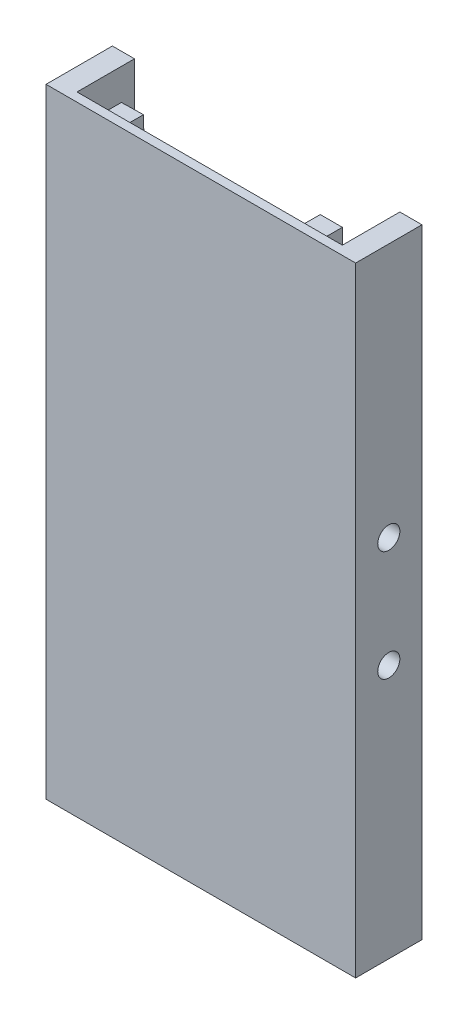
ISO-10303-21;
HEADER;
FILE_DESCRIPTION(('STEP AP214'),'2;1');
FILE_NAME('part.step','',(''),(''),'','','');
FILE_SCHEMA(('AUTOMOTIVE_DESIGN { 1 0 10303 214 1 1 1 1 }'));
ENDSEC;
DATA;
#1=APPLICATION_CONTEXT('core data for automotive mechanical design processes');
#2=APPLICATION_PROTOCOL_DEFINITION('international standard','automotive_design',2000,#1);
#3=PRODUCT_CONTEXT('',#1,'mechanical');
#4=PRODUCT('Part','Part','',(#3));
#5=PRODUCT_RELATED_PRODUCT_CATEGORY('part','',(#4));
#6=PRODUCT_DEFINITION_FORMATION('','',#4);
#7=PRODUCT_DEFINITION_CONTEXT('part definition',#1,'design');
#8=PRODUCT_DEFINITION('design','',#6,#7);
#9=PRODUCT_DEFINITION_SHAPE('','',#8);
#10=(LENGTH_UNIT() NAMED_UNIT(*) SI_UNIT(.MILLI.,.METRE.));
#11=(NAMED_UNIT(*) PLANE_ANGLE_UNIT() SI_UNIT($,.RADIAN.));
#12=(NAMED_UNIT(*) SI_UNIT($,.STERADIAN.) SOLID_ANGLE_UNIT());
#13=UNCERTAINTY_MEASURE_WITH_UNIT(LENGTH_MEASURE(1.E-05),#10,'distance_accuracy_value','');
#14=(GEOMETRIC_REPRESENTATION_CONTEXT(3) GLOBAL_UNCERTAINTY_ASSIGNED_CONTEXT((#13)) GLOBAL_UNIT_ASSIGNED_CONTEXT((#10,
#11,#12)) REPRESENTATION_CONTEXT('',''));
#15=CARTESIAN_POINT('',(0.,0.,0.));
#16=DIRECTION('',(0.,0.,1.));
#17=DIRECTION('',(1.,0.,0.));
#18=AXIS2_PLACEMENT_3D('',#15,#16,#17);
#19=CARTESIAN_POINT('',(65.,298.888888888889,-2.));
#20=DIRECTION('',(0.,0.,1.));
#21=DIRECTION('',(1.,0.,0.));
#22=AXIS2_PLACEMENT_3D('',#19,#20,#21);
#23=PLANE('',#22);
#24=DIRECTION('',(0.0214261117983908,0.999770434516446,0.));
#25=VECTOR('',#24,1.);
#26=CARTESIAN_POINT('',(10.0378783047865,300.924197335623,-1.99999999999999));
#27=LINE('',#26,#25);
#28=CARTESIAN_POINT('',(10.0378783047865,300.924197335623,-1.99999999999999));
#29=VERTEX_POINT('',#28);
#30=CARTESIAN_POINT('',(10.1450088637784,305.923049508205,-1.99999999999999));
#31=VERTEX_POINT('',#30);
#32=EDGE_CURVE('E224',#29,#31,#27,.T.);
#33=ORIENTED_EDGE('',*,*,#32,.F.);
#34=DIRECTION('',(-0.999770434516446,0.0214261117983949,0.));
#35=VECTOR('',#34,1.);
#36=CARTESIAN_POINT('',(10.0378783047865,300.924197335623,-1.99999999999999));
#37=LINE('',#36,#35);
#38=CARTESIAN_POINT('',(15.0367304773687,300.817066776631,-1.99999999999999));
#39=VERTEX_POINT('',#38);
#40=EDGE_CURVE('E237',#39,#29,#37,.T.);
#41=ORIENTED_EDGE('',*,*,#40,.F.);
#42=DIRECTION('',(-0.0214261117983908,-0.999770434516446,0.));
#43=VECTOR('',#42,1.);
#44=CARTESIAN_POINT('',(15.0367304773687,300.817066776631,-1.99999999999999));
#45=LINE('',#44,#43);
#46=CARTESIAN_POINT('',(15.1438610363607,305.815918949213,-1.99999999999999));
#47=VERTEX_POINT('',#46);
#48=EDGE_CURVE('E246',#47,#39,#45,.T.);
#49=ORIENTED_EDGE('',*,*,#48,.F.);
#50=DIRECTION('',(0.999770434516446,-0.0214261117983949,0.));
#51=VECTOR('',#50,1.);
#52=CARTESIAN_POINT('',(10.1450088637784,305.923049508205,-1.99999999999999));
#53=LINE('',#52,#51);
#54=EDGE_CURVE('E227',#31,#47,#53,.T.);
#55=ORIENTED_EDGE('',*,*,#54,.F.);
#56=EDGE_LOOP('',(#33,#41,#49,#55));
#57=FACE_BOUND('',#56,.T.);
#58=DIRECTION('',(0.,-1.,0.));
#59=VECTOR('',#58,1.);
#60=CARTESIAN_POINT('',(60.,437.388888888889,-2.));
#61=LINE('',#60,#59);
#62=CARTESIAN_POINT('',(60.,437.388888888889,-2.));
#63=VERTEX_POINT('',#62);
#64=CARTESIAN_POINT('',(60.,432.388888888889,-2.));
#65=VERTEX_POINT('',#64);
#66=EDGE_CURVE('E295',#63,#65,#61,.T.);
#67=ORIENTED_EDGE('',*,*,#66,.F.);
#68=DIRECTION('',(1.,0.,0.));
#69=VECTOR('',#68,1.);
#70=CARTESIAN_POINT('',(60.,437.388888888889,-2.));
#71=LINE('',#70,#69);
#72=CARTESIAN_POINT('',(55.,437.388888888889,-2.));
#73=VERTEX_POINT('',#72);
#74=EDGE_CURVE('E300',#73,#63,#71,.T.);
#75=ORIENTED_EDGE('',*,*,#74,.F.);
#76=DIRECTION('',(0.,1.,0.));
#77=VECTOR('',#76,1.);
#78=CARTESIAN_POINT('',(55.,437.388888888889,-2.));
#79=LINE('',#78,#77);
#80=CARTESIAN_POINT('',(55.,432.388888888889,-2.));
#81=VERTEX_POINT('',#80);
#82=EDGE_CURVE('E312',#81,#73,#79,.T.);
#83=ORIENTED_EDGE('',*,*,#82,.F.);
#84=DIRECTION('',(-1.,0.,0.));
#85=VECTOR('',#84,1.);
#86=CARTESIAN_POINT('',(60.,432.388888888889,-2.));
#87=LINE('',#86,#85);
#88=EDGE_CURVE('E309',#65,#81,#87,.T.);
#89=ORIENTED_EDGE('',*,*,#88,.F.);
#90=EDGE_LOOP('',(#67,#75,#83,#89));
#91=FACE_BOUND('',#90,.T.);
#92=DIRECTION('',(1.,0.,0.));
#93=VECTOR('',#92,1.);
#94=CARTESIAN_POINT('',(65.,438.888888888889,-2.));
#95=LINE('',#94,#93);
#96=CARTESIAN_POINT('',(5.,438.888888888889,-1.99999999999999));
#97=VERTEX_POINT('',#96);
#98=CARTESIAN_POINT('',(65.,438.888888888889,-2.));
#99=VERTEX_POINT('',#98);
#100=EDGE_CURVE('E369',#97,#99,#95,.T.);
#101=ORIENTED_EDGE('',*,*,#100,.T.);
#102=DIRECTION('',(0.,1.,0.));
#103=VECTOR('',#102,1.);
#104=CARTESIAN_POINT('',(65.,298.888888888889,-2.));
#105=LINE('',#104,#103);
#106=CARTESIAN_POINT('',(65.,298.888888888889,-2.));
#107=VERTEX_POINT('',#106);
#108=EDGE_CURVE('E374',#107,#99,#105,.T.);
#109=ORIENTED_EDGE('',*,*,#108,.F.);
#110=DIRECTION('',(1.,0.,0.));
#111=VECTOR('',#110,1.);
#112=CARTESIAN_POINT('',(65.,298.888888888889,-2.));
#113=LINE('',#112,#111);
#114=CARTESIAN_POINT('',(36.5,298.888888888889,-1.99999999999997));
#115=VERTEX_POINT('',#114);
#116=EDGE_CURVE('E358',#115,#107,#113,.T.);
#117=ORIENTED_EDGE('',*,*,#116,.F.);
#118=DIRECTION('',(1.,0.,0.));
#119=VECTOR('',#118,1.);
#120=CARTESIAN_POINT('',(33.5,298.888888888889,-1.99999999999997));
#121=LINE('',#120,#119);
#122=CARTESIAN_POINT('',(33.5,298.888888888889,-2.));
#123=VERTEX_POINT('',#122);
#124=EDGE_CURVE('E333',#123,#115,#121,.T.);
#125=ORIENTED_EDGE('',*,*,#124,.F.);
#126=CARTESIAN_POINT('',(5.,298.888888888889,-1.99999999999999));
#127=VERTEX_POINT('',#126);
#128=EDGE_CURVE('E360',#127,#123,#113,.T.);
#129=ORIENTED_EDGE('',*,*,#128,.F.);
#130=DIRECTION('',(0.,1.,0.));
#131=VECTOR('',#130,1.);
#132=CARTESIAN_POINT('',(5.,298.888888888889,-1.99999999999999));
#133=LINE('',#132,#131);
#134=EDGE_CURVE('E366',#127,#97,#133,.T.);
#135=ORIENTED_EDGE('',*,*,#134,.T.);
#136=EDGE_LOOP('',(#101,#109,#117,#125,#129,#135));
#137=FACE_BOUND('',#136,.T.);
#138=DIRECTION('',(-0.0214261117983908,0.999770434516446,0.));
#139=VECTOR('',#138,1.);
#140=CARTESIAN_POINT('',(10.0378783047865,436.853580442154,-1.99999999999999));
#141=LINE('',#140,#139);
#142=CARTESIAN_POINT('',(10.1450088637784,431.854728269572,-1.99999999999999));
#143=VERTEX_POINT('',#142);
#144=CARTESIAN_POINT('',(10.0378783047864,436.853580442154,-1.99999999999999));
#145=VERTEX_POINT('',#144);
#146=EDGE_CURVE('E262',#143,#145,#141,.T.);
#147=ORIENTED_EDGE('',*,*,#146,.F.);
#148=DIRECTION('',(-0.999770434516446,-0.0214261117983949,0.));
#149=VECTOR('',#148,1.);
#150=CARTESIAN_POINT('',(10.1450088637784,431.854728269572,-1.99999999999999));
#151=LINE('',#150,#149);
#152=CARTESIAN_POINT('',(15.1438610363606,431.961858828564,-1.99999999999999));
#153=VERTEX_POINT('',#152);
#154=EDGE_CURVE('E267',#153,#143,#151,.T.);
#155=ORIENTED_EDGE('',*,*,#154,.F.);
#156=DIRECTION('',(0.0214261117983908,-0.999770434516446,0.));
#157=VECTOR('',#156,1.);
#158=CARTESIAN_POINT('',(15.0367304773687,436.960711001146,-1.99999999999999));
#159=LINE('',#158,#157);
#160=CARTESIAN_POINT('',(15.0367304773687,436.960711001146,-1.99999999999999));
#161=VERTEX_POINT('',#160);
#162=EDGE_CURVE('E279',#161,#153,#159,.T.);
#163=ORIENTED_EDGE('',*,*,#162,.F.);
#164=DIRECTION('',(0.999770434516446,0.0214261117983949,0.));
#165=VECTOR('',#164,1.);
#166=CARTESIAN_POINT('',(10.0378783047865,436.853580442154,-1.99999999999999));
#167=LINE('',#166,#165);
#168=EDGE_CURVE('E276',#145,#161,#167,.T.);
#169=ORIENTED_EDGE('',*,*,#168,.F.);
#170=EDGE_LOOP('',(#147,#155,#163,#169));
#171=FACE_BOUND('',#170,.T.);
#172=DIRECTION('',(0.,-1.,0.));
#173=VECTOR('',#172,1.);
#174=CARTESIAN_POINT('',(60.,300.388888888889,-2.));
#175=LINE('',#174,#173);
#176=CARTESIAN_POINT('',(60.,305.388888888889,-2.));
#177=VERTEX_POINT('',#176);
#178=CARTESIAN_POINT('',(60.,300.388888888889,-2.));
#179=VERTEX_POINT('',#178);
#180=EDGE_CURVE('E223',#177,#179,#175,.T.);
#181=ORIENTED_EDGE('',*,*,#180,.F.);
#182=DIRECTION('',(1.,0.,0.));
#183=VECTOR('',#182,1.);
#184=CARTESIAN_POINT('',(60.,305.388888888889,-2.));
#185=LINE('',#184,#183);
#186=CARTESIAN_POINT('',(55.,305.388888888889,-2.));
#187=VERTEX_POINT('',#186);
#188=EDGE_CURVE('E220',#187,#177,#185,.T.);
#189=ORIENTED_EDGE('',*,*,#188,.F.);
#190=DIRECTION('',(0.,1.,0.));
#191=VECTOR('',#190,1.);
#192=CARTESIAN_POINT('',(55.,300.388888888889,-2.));
#193=LINE('',#192,#191);
#194=CARTESIAN_POINT('',(55.,300.388888888889,-2.));
#195=VERTEX_POINT('',#194);
#196=EDGE_CURVE('E57',#195,#187,#193,.T.);
#197=ORIENTED_EDGE('',*,*,#196,.F.);
#198=DIRECTION('',(-1.,0.,0.));
#199=VECTOR('',#198,1.);
#200=CARTESIAN_POINT('',(60.,300.388888888889,-2.));
#201=LINE('',#200,#199);
#202=EDGE_CURVE('E52',#179,#195,#201,.T.);
#203=ORIENTED_EDGE('',*,*,#202,.F.);
#204=EDGE_LOOP('',(#181,#189,#197,#203));
#205=FACE_BOUND('',#204,.T.);
#206=ADVANCED_FACE('F35',(#57,#91,#137,#171,#205),#23,.F.);
#207=CARTESIAN_POINT('',(0.,0.,-15.));
#208=DIRECTION('',(0.,0.,1.));
#209=DIRECTION('',(1.,0.,0.));
#210=AXIS2_PLACEMENT_3D('',#207,#208,#209);
#211=PLANE('',#210);
#212=DIRECTION('',(1.,0.,0.));
#213=VECTOR('',#212,1.);
#214=CARTESIAN_POINT('',(0.,298.888888888889,-15.));
#215=LINE('',#214,#213);
#216=CARTESIAN_POINT('',(65.,298.888888888889,-15.));
#217=VERTEX_POINT('',#216);
#218=CARTESIAN_POINT('',(70.,298.888888888889,-15.));
#219=VERTEX_POINT('',#218);
#220=EDGE_CURVE('E386',#217,#219,#215,.T.);
#221=ORIENTED_EDGE('',*,*,#220,.F.);
#222=DIRECTION('',(0.,-1.,0.));
#223=VECTOR('',#222,1.);
#224=CARTESIAN_POINT('',(65.,433.888888888889,-15.));
#225=LINE('',#224,#223);
#226=CARTESIAN_POINT('',(65.,438.888888888889,-15.));
#227=VERTEX_POINT('',#226);
#228=EDGE_CURVE('E376',#227,#217,#225,.T.);
#229=ORIENTED_EDGE('',*,*,#228,.F.);
#230=DIRECTION('',(-1.,0.,0.));
#231=VECTOR('',#230,1.);
#232=CARTESIAN_POINT('',(0.,438.888888888889,-15.));
#233=LINE('',#232,#231);
#234=CARTESIAN_POINT('',(70.,438.888888888889,-15.));
#235=VERTEX_POINT('',#234);
#236=EDGE_CURVE('E390',#235,#227,#233,.T.);
#237=ORIENTED_EDGE('',*,*,#236,.F.);
#238=DIRECTION('',(0.,1.,0.));
#239=VECTOR('',#238,1.);
#240=CARTESIAN_POINT('',(70.,298.888888888889,-15.));
#241=LINE('',#240,#239);
#242=EDGE_CURVE('E385',#219,#235,#241,.T.);
#243=ORIENTED_EDGE('',*,*,#242,.F.);
#244=EDGE_LOOP('',(#221,#229,#237,#243));
#245=FACE_BOUND('',#244,.T.);
#246=ADVANCED_FACE('F438',(#245),#211,.F.);
#247=CARTESIAN_POINT('',(0.,298.888888888889,-15.));
#248=DIRECTION('',(0.,-1.,0.));
#249=DIRECTION('',(0.,0.,-1.));
#250=AXIS2_PLACEMENT_3D('',#247,#248,#249);
#251=PLANE('',#250);
#252=CARTESIAN_POINT('',(35.,298.888888888889,-1.99999999999999));
#253=DIRECTION('',(0.,-1.,0.));
#254=DIRECTION('',(0.,0.,1.));
#255=AXIS2_PLACEMENT_3D('',#252,#253,#254);
#256=CIRCLE('',#255,1.5);
#257=EDGE_CURVE('E328',#115,#123,#256,.T.);
#258=ORIENTED_EDGE('',*,*,#257,.F.);
#259=ORIENTED_EDGE('',*,*,#116,.T.);
#260=DIRECTION('',(0.,0.,-1.));
#261=VECTOR('',#260,1.);
#262=CARTESIAN_POINT('',(65.,298.888888888889,-15.));
#263=LINE('',#262,#261);
#264=EDGE_CURVE('E363',#107,#217,#263,.T.);
#265=ORIENTED_EDGE('',*,*,#264,.T.);
#266=ORIENTED_EDGE('',*,*,#220,.T.);
#267=DIRECTION('',(0.,0.,1.));
#268=VECTOR('',#267,1.);
#269=CARTESIAN_POINT('',(70.,298.888888888889,-15.));
#270=LINE('',#269,#268);
#271=CARTESIAN_POINT('',(70.,298.888888888889,0.));
#272=VERTEX_POINT('',#271);
#273=EDGE_CURVE('E396',#219,#272,#270,.T.);
#274=ORIENTED_EDGE('',*,*,#273,.T.);
#275=DIRECTION('',(1.,0.,0.));
#276=VECTOR('',#275,1.);
#277=CARTESIAN_POINT('',(0.,298.888888888889,0.));
#278=LINE('',#277,#276);
#279=CARTESIAN_POINT('',(0.,298.888888888889,0.));
#280=VERTEX_POINT('',#279);
#281=EDGE_CURVE('E381',#280,#272,#278,.T.);
#282=ORIENTED_EDGE('',*,*,#281,.F.);
#283=DIRECTION('',(0.,0.,1.));
#284=VECTOR('',#283,1.);
#285=CARTESIAN_POINT('',(0.,298.888888888889,-15.));
#286=LINE('',#285,#284);
#287=CARTESIAN_POINT('',(0.,298.888888888889,-15.));
#288=VERTEX_POINT('',#287);
#289=EDGE_CURVE('E11',#288,#280,#286,.T.);
#290=ORIENTED_EDGE('',*,*,#289,.F.);
#291=CARTESIAN_POINT('',(5.,298.888888888889,-15.));
#292=VERTEX_POINT('',#291);
#293=EDGE_CURVE('E382',#288,#292,#215,.T.);
#294=ORIENTED_EDGE('',*,*,#293,.T.);
#295=DIRECTION('',(0.,0.,1.));
#296=VECTOR('',#295,1.);
#297=CARTESIAN_POINT('',(5.,298.888888888889,-15.));
#298=LINE('',#297,#296);
#299=EDGE_CURVE('E355',#292,#127,#298,.T.);
#300=ORIENTED_EDGE('',*,*,#299,.T.);
#301=ORIENTED_EDGE('',*,*,#128,.T.);
#302=EDGE_LOOP('',(#258,#259,#265,#266,#274,#282,#290,#294,#300,#301));
#303=FACE_BOUND('',#302,.T.);
#304=ADVANCED_FACE('F37',(#303),#251,.T.);
#305=CARTESIAN_POINT('',(0.,438.888888888889,-15.));
#306=DIRECTION('',(-1.,0.,0.));
#307=DIRECTION('',(0.,-1.,0.));
#308=AXIS2_PLACEMENT_3D('',#305,#306,#307);
#309=PLANE('',#308);
#310=CARTESIAN_POINT('',(0.,381.388888888889,-7.49999999999999));
#311=DIRECTION('',(-1.,0.,0.));
#312=DIRECTION('',(0.,-1.,0.));
#313=AXIS2_PLACEMENT_3D('',#310,#311,#312);
#314=CIRCLE('',#313,2.5);
#315=CARTESIAN_POINT('',(0.,378.888888888889,-7.49999999999999));
#316=VERTEX_POINT('',#315);
#317=EDGE_CURVE('E340',#316,#316,#314,.T.);
#318=ORIENTED_EDGE('',*,*,#317,.F.);
#319=EDGE_LOOP('',(#318));
#320=FACE_BOUND('',#319,.T.);
#321=CARTESIAN_POINT('',(0.,356.388888888889,-7.49999999999999));
#322=DIRECTION('',(-1.,0.,0.));
#323=DIRECTION('',(0.,1.,0.));
#324=AXIS2_PLACEMENT_3D('',#321,#322,#323);
#325=CIRCLE('',#324,2.5);
#326=CARTESIAN_POINT('',(0.,358.888888888889,-7.49999999999999));
#327=VERTEX_POINT('',#326);
#328=EDGE_CURVE('E335',#327,#327,#325,.T.);
#329=ORIENTED_EDGE('',*,*,#328,.F.);
#330=EDGE_LOOP('',(#329));
#331=FACE_BOUND('',#330,.T.);
#332=DIRECTION('',(0.,-1.,0.));
#333=VECTOR('',#332,1.);
#334=CARTESIAN_POINT('',(0.,438.888888888889,0.));
#335=LINE('',#334,#333);
#336=CARTESIAN_POINT('',(0.,438.888888888889,0.));
#337=VERTEX_POINT('',#336);
#338=EDGE_CURVE('E405',#337,#280,#335,.T.);
#339=ORIENTED_EDGE('',*,*,#338,.F.);
#340=DIRECTION('',(0.,0.,1.));
#341=VECTOR('',#340,1.);
#342=CARTESIAN_POINT('',(0.,438.888888888889,-15.));
#343=LINE('',#342,#341);
#344=CARTESIAN_POINT('',(0.,438.888888888889,-15.));
#345=VERTEX_POINT('',#344);
#346=EDGE_CURVE('E44',#345,#337,#343,.T.);
#347=ORIENTED_EDGE('',*,*,#346,.F.);
#348=DIRECTION('',(0.,-1.,0.));
#349=VECTOR('',#348,1.);
#350=CARTESIAN_POINT('',(0.,438.888888888889,-15.));
#351=LINE('',#350,#349);
#352=EDGE_CURVE('E393',#345,#288,#351,.T.);
#353=ORIENTED_EDGE('',*,*,#352,.T.);
#354=ORIENTED_EDGE('',*,*,#289,.T.);
#355=EDGE_LOOP('',(#339,#347,#353,#354));
#356=FACE_BOUND('',#355,.T.);
#357=ADVANCED_FACE('F458',(#320,#331,#356),#309,.T.);
#358=CARTESIAN_POINT('',(0.,438.888888888889,-15.));
#359=DIRECTION('',(0.,1.,0.));
#360=DIRECTION('',(0.,0.,1.));
#361=AXIS2_PLACEMENT_3D('',#358,#359,#360);
#362=PLANE('',#361);
#363=DIRECTION('',(0.,0.,-1.));
#364=VECTOR('',#363,1.);
#365=CARTESIAN_POINT('',(65.,438.888888888889,-15.));
#366=LINE('',#365,#364);
#367=EDGE_CURVE('E359',#99,#227,#366,.T.);
#368=ORIENTED_EDGE('',*,*,#367,.F.);
#369=ORIENTED_EDGE('',*,*,#100,.F.);
#370=DIRECTION('',(0.,0.,1.));
#371=VECTOR('',#370,1.);
#372=CARTESIAN_POINT('',(5.,438.888888888889,-15.));
#373=LINE('',#372,#371);
#374=CARTESIAN_POINT('',(5.,438.888888888889,-15.));
#375=VERTEX_POINT('',#374);
#376=EDGE_CURVE('E354',#375,#97,#373,.T.);
#377=ORIENTED_EDGE('',*,*,#376,.F.);
#378=EDGE_CURVE('E389',#375,#345,#233,.T.);
#379=ORIENTED_EDGE('',*,*,#378,.T.);
#380=ORIENTED_EDGE('',*,*,#346,.T.);
#381=DIRECTION('',(-1.,0.,0.));
#382=VECTOR('',#381,1.);
#383=CARTESIAN_POINT('',(0.,438.888888888889,0.));
#384=LINE('',#383,#382);
#385=CARTESIAN_POINT('',(70.,438.888888888889,0.));
#386=VERTEX_POINT('',#385);
#387=EDGE_CURVE('E402',#386,#337,#384,.T.);
#388=ORIENTED_EDGE('',*,*,#387,.F.);
#389=DIRECTION('',(0.,0.,1.));
#390=VECTOR('',#389,1.);
#391=CARTESIAN_POINT('',(70.,438.888888888889,-15.));
#392=LINE('',#391,#390);
#393=EDGE_CURVE('E409',#235,#386,#392,.T.);
#394=ORIENTED_EDGE('',*,*,#393,.F.);
#395=ORIENTED_EDGE('',*,*,#236,.T.);
#396=EDGE_LOOP('',(#368,#369,#377,#379,#380,#388,#394,#395));
#397=FACE_BOUND('',#396,.T.);
#398=ADVANCED_FACE('F461',(#397),#362,.T.);
#399=CARTESIAN_POINT('',(70.,298.888888888889,-15.));
#400=DIRECTION('',(1.,0.,0.));
#401=DIRECTION('',(0.,0.,-1.));
#402=AXIS2_PLACEMENT_3D('',#399,#400,#401);
#403=PLANE('',#402);
#404=CARTESIAN_POINT('',(70.,381.388888888889,-7.49999999999999));
#405=DIRECTION('',(-1.,0.,0.));
#406=DIRECTION('',(0.,-1.,0.));
#407=AXIS2_PLACEMENT_3D('',#404,#405,#406);
#408=CIRCLE('',#407,2.5);
#409=CARTESIAN_POINT('',(70.,378.888888888889,-7.49999999999999));
#410=VERTEX_POINT('',#409);
#411=EDGE_CURVE('E336',#410,#410,#408,.T.);
#412=ORIENTED_EDGE('',*,*,#411,.T.);
#413=EDGE_LOOP('',(#412));
#414=FACE_BOUND('',#413,.T.);
#415=CARTESIAN_POINT('',(70.,356.388888888889,-7.49999999999999));
#416=DIRECTION('',(-1.,0.,0.));
#417=DIRECTION('',(0.,1.,0.));
#418=AXIS2_PLACEMENT_3D('',#415,#416,#417);
#419=CIRCLE('',#418,2.5);
#420=CARTESIAN_POINT('',(70.,358.888888888889,-7.49999999999999));
#421=VERTEX_POINT('',#420);
#422=EDGE_CURVE('E343',#421,#421,#419,.T.);
#423=ORIENTED_EDGE('',*,*,#422,.T.);
#424=EDGE_LOOP('',(#423));
#425=FACE_BOUND('',#424,.T.);
#426=DIRECTION('',(0.,1.,0.));
#427=VECTOR('',#426,1.);
#428=CARTESIAN_POINT('',(70.,298.888888888889,0.));
#429=LINE('',#428,#427);
#430=EDGE_CURVE('E399',#272,#386,#429,.T.);
#431=ORIENTED_EDGE('',*,*,#430,.F.);
#432=ORIENTED_EDGE('',*,*,#273,.F.);
#433=ORIENTED_EDGE('',*,*,#242,.T.);
#434=ORIENTED_EDGE('',*,*,#393,.T.);
#435=EDGE_LOOP('',(#431,#432,#433,#434));
#436=FACE_BOUND('',#435,.T.);
#437=ADVANCED_FACE('F453',(#414,#425,#436),#403,.T.);
#438=ORIENTED_EDGE('',*,*,#378,.F.);
#439=DIRECTION('',(0.,1.,0.));
#440=VECTOR('',#439,1.);
#441=CARTESIAN_POINT('',(5.,303.888888888889,-15.));
#442=LINE('',#441,#440);
#443=EDGE_CURVE('E379',#292,#375,#442,.T.);
#444=ORIENTED_EDGE('',*,*,#443,.F.);
#445=ORIENTED_EDGE('',*,*,#293,.F.);
#446=ORIENTED_EDGE('',*,*,#352,.F.);
#447=EDGE_LOOP('',(#438,#444,#445,#446));
#448=FACE_BOUND('',#447,.T.);
#449=ADVANCED_FACE('F445',(#448),#211,.F.);
#450=CARTESIAN_POINT('',(0.,0.,0.));
#451=DIRECTION('',(0.,0.,1.));
#452=DIRECTION('',(1.,0.,0.));
#453=AXIS2_PLACEMENT_3D('',#450,#451,#452);
#454=PLANE('',#453);
#455=ORIENTED_EDGE('',*,*,#281,.T.);
#456=ORIENTED_EDGE('',*,*,#430,.T.);
#457=ORIENTED_EDGE('',*,*,#387,.T.);
#458=ORIENTED_EDGE('',*,*,#338,.T.);
#459=EDGE_LOOP('',(#455,#456,#457,#458));
#460=FACE_BOUND('',#459,.T.);
#461=ADVANCED_FACE('F449',(#460),#454,.T.);
#462=CARTESIAN_POINT('',(5.,303.888888888889,-2.5));
#463=DIRECTION('',(-1.,0.,0.));
#464=DIRECTION('',(0.,0.,1.));
#465=AXIS2_PLACEMENT_3D('',#462,#463,#464);
#466=PLANE('',#465);
#467=CARTESIAN_POINT('',(4.99999999999999,381.388888888889,-7.49999999999999));
#468=DIRECTION('',(-1.,0.,0.));
#469=DIRECTION('',(0.,0.,1.));
#470=AXIS2_PLACEMENT_3D('',#467,#468,#469);
#471=CIRCLE('',#470,2.5);
#472=CARTESIAN_POINT('',(4.99999999999999,381.388888888889,-4.99999999999999));
#473=VERTEX_POINT('',#472);
#474=EDGE_CURVE('E351',#473,#473,#471,.T.);
#475=ORIENTED_EDGE('',*,*,#474,.T.);
#476=EDGE_LOOP('',(#475));
#477=FACE_BOUND('',#476,.T.);
#478=CARTESIAN_POINT('',(4.99999999999999,356.388888888889,-7.49999999999999));
#479=DIRECTION('',(-1.,0.,0.));
#480=DIRECTION('',(0.,0.,1.));
#481=AXIS2_PLACEMENT_3D('',#478,#479,#480);
#482=CIRCLE('',#481,2.5);
#483=CARTESIAN_POINT('',(4.99999999999999,356.388888888889,-4.99999999999999));
#484=VERTEX_POINT('',#483);
#485=EDGE_CURVE('E348',#484,#484,#482,.T.);
#486=ORIENTED_EDGE('',*,*,#485,.T.);
#487=EDGE_LOOP('',(#486));
#488=FACE_BOUND('',#487,.T.);
#489=ORIENTED_EDGE('',*,*,#443,.T.);
#490=ORIENTED_EDGE('',*,*,#376,.T.);
#491=ORIENTED_EDGE('',*,*,#134,.F.);
#492=ORIENTED_EDGE('',*,*,#299,.F.);
#493=EDGE_LOOP('',(#489,#490,#491,#492));
#494=FACE_BOUND('',#493,.T.);
#495=ADVANCED_FACE('F430',(#477,#488,#494),#466,.F.);
#496=CARTESIAN_POINT('',(65.,433.888888888889,-2.5));
#497=DIRECTION('',(1.,0.,0.));
#498=DIRECTION('',(0.,1.,0.));
#499=AXIS2_PLACEMENT_3D('',#496,#497,#498);
#500=PLANE('',#499);
#501=CARTESIAN_POINT('',(65.,381.388888888889,-7.49999999999999));
#502=DIRECTION('',(1.,0.,0.));
#503=DIRECTION('',(0.,1.,0.));
#504=AXIS2_PLACEMENT_3D('',#501,#502,#503);
#505=CIRCLE('',#504,2.5);
#506=CARTESIAN_POINT('',(65.,383.888888888889,-7.49999999999999));
#507=VERTEX_POINT('',#506);
#508=EDGE_CURVE('E39',#507,#507,#505,.T.);
#509=ORIENTED_EDGE('',*,*,#508,.T.);
#510=EDGE_LOOP('',(#509));
#511=FACE_BOUND('',#510,.T.);
#512=CARTESIAN_POINT('',(65.,356.388888888889,-7.49999999999999));
#513=DIRECTION('',(1.,0.,0.));
#514=DIRECTION('',(0.,1.,0.));
#515=AXIS2_PLACEMENT_3D('',#512,#513,#514);
#516=CIRCLE('',#515,2.5);
#517=CARTESIAN_POINT('',(65.,358.888888888889,-7.49999999999999));
#518=VERTEX_POINT('',#517);
#519=EDGE_CURVE('E339',#518,#518,#516,.T.);
#520=ORIENTED_EDGE('',*,*,#519,.T.);
#521=EDGE_LOOP('',(#520));
#522=FACE_BOUND('',#521,.T.);
#523=ORIENTED_EDGE('',*,*,#367,.T.);
#524=ORIENTED_EDGE('',*,*,#228,.T.);
#525=ORIENTED_EDGE('',*,*,#264,.F.);
#526=ORIENTED_EDGE('',*,*,#108,.T.);
#527=EDGE_LOOP('',(#523,#524,#525,#526));
#528=FACE_BOUND('',#527,.T.);
#529=ADVANCED_FACE('F414',(#511,#522,#528),#500,.F.);
#530=CARTESIAN_POINT('',(70.,356.388888888889,-7.49999999999999));
#531=DIRECTION('',(-1.,0.,0.));
#532=DIRECTION('',(0.,-1.,0.));
#533=AXIS2_PLACEMENT_3D('',#530,#531,#532);
#534=CYLINDRICAL_SURFACE('',#533,2.5);
#535=ORIENTED_EDGE('',*,*,#422,.F.);
#536=EDGE_LOOP('',(#535));
#537=FACE_BOUND('',#536,.T.);
#538=ORIENTED_EDGE('',*,*,#519,.F.);
#539=EDGE_LOOP('',(#538));
#540=FACE_BOUND('',#539,.T.);
#541=ADVANCED_FACE('F417',(#537,#540),#534,.F.);
#542=CARTESIAN_POINT('',(70.,381.388888888889,-7.49999999999999));
#543=DIRECTION('',(-1.,0.,0.));
#544=DIRECTION('',(0.,-1.,0.));
#545=AXIS2_PLACEMENT_3D('',#542,#543,#544);
#546=CYLINDRICAL_SURFACE('',#545,2.5);
#547=ORIENTED_EDGE('',*,*,#411,.F.);
#548=EDGE_LOOP('',(#547));
#549=FACE_BOUND('',#548,.T.);
#550=ORIENTED_EDGE('',*,*,#508,.F.);
#551=EDGE_LOOP('',(#550));
#552=FACE_BOUND('',#551,.T.);
#553=ADVANCED_FACE('F419',(#549,#552),#546,.F.);
#554=ORIENTED_EDGE('',*,*,#328,.T.);
#555=EDGE_LOOP('',(#554));
#556=FACE_BOUND('',#555,.T.);
#557=ORIENTED_EDGE('',*,*,#485,.F.);
#558=EDGE_LOOP('',(#557));
#559=FACE_BOUND('',#558,.T.);
#560=ADVANCED_FACE('F422',(#556,#559),#534,.F.);
#561=ORIENTED_EDGE('',*,*,#317,.T.);
#562=EDGE_LOOP('',(#561));
#563=FACE_BOUND('',#562,.T.);
#564=ORIENTED_EDGE('',*,*,#474,.F.);
#565=EDGE_LOOP('',(#564));
#566=FACE_BOUND('',#565,.T.);
#567=ADVANCED_FACE('F429',(#563,#566),#546,.F.);
#568=CARTESIAN_POINT('',(35.,298.888888888889,-1.99999999999997));
#569=DIRECTION('',(1.,0.,0.));
#570=DIRECTION('',(0.,-0.500000000000052,-0.866025403784408));
#571=AXIS2_PLACEMENT_3D('',#568,#569,#570);
#572=SPHERICAL_SURFACE('',#571,1.5);
#573=ORIENTED_EDGE('',*,*,#257,.T.);
#574=CARTESIAN_POINT('',(35.,298.888888888889,-1.99999999999997));
#575=DIRECTION('',(0.,-0.866025403784408,0.500000000000052));
#576=DIRECTION('',(0.,0.500000000000052,0.866025403784408));
#577=AXIS2_PLACEMENT_3D('',#574,#575,#576);
#578=CIRCLE('',#577,1.5);
#579=EDGE_CURVE('E331',#115,#123,#578,.T.);
#580=ORIENTED_EDGE('',*,*,#579,.F.);
#581=EDGE_LOOP('',(#573,#580));
#582=FACE_BOUND('',#581,.T.);
#583=ADVANCED_FACE('F503',(#582),#572,.F.);
#584=CARTESIAN_POINT('',(35.,298.888888888889,-1.99999999999997));
#585=DIRECTION('',(0.,0.866025403784408,-0.500000000000052));
#586=DIRECTION('',(0.,0.500000000000052,0.866025403784408));
#587=AXIS2_PLACEMENT_3D('',#584,#585,#586);
#588=PLANE('',#587);
#589=ORIENTED_EDGE('',*,*,#579,.T.);
#590=ORIENTED_EDGE('',*,*,#124,.T.);
#591=EDGE_LOOP('',(#589,#590));
#592=FACE_BOUND('',#591,.T.);
#593=ADVANCED_FACE('F501',(#592),#588,.F.);
#594=CARTESIAN_POINT('',(60.,437.388888888889,-7.));
#595=DIRECTION('',(-1.,0.,0.));
#596=DIRECTION('',(0.,0.,1.));
#597=AXIS2_PLACEMENT_3D('',#594,#595,#596);
#598=PLANE('',#597);
#599=ORIENTED_EDGE('',*,*,#66,.T.);
#600=DIRECTION('',(0.,0.,1.));
#601=VECTOR('',#600,1.);
#602=CARTESIAN_POINT('',(60.,432.388888888889,-7.));
#603=LINE('',#602,#601);
#604=CARTESIAN_POINT('',(60.,432.388888888889,-7.));
#605=VERTEX_POINT('',#604);
#606=EDGE_CURVE('E325',#605,#65,#603,.T.);
#607=ORIENTED_EDGE('',*,*,#606,.F.);
#608=DIRECTION('',(0.,-1.,0.));
#609=VECTOR('',#608,1.);
#610=CARTESIAN_POINT('',(60.,437.388888888889,-7.));
#611=LINE('',#610,#609);
#612=CARTESIAN_POINT('',(60.,437.388888888889,-7.));
#613=VERTEX_POINT('',#612);
#614=EDGE_CURVE('E296',#613,#605,#611,.T.);
#615=ORIENTED_EDGE('',*,*,#614,.F.);
#616=DIRECTION('',(0.,0.,1.));
#617=VECTOR('',#616,1.);
#618=CARTESIAN_POINT('',(60.,437.388888888889,-7.));
#619=LINE('',#618,#617);
#620=EDGE_CURVE('E306',#613,#63,#619,.T.);
#621=ORIENTED_EDGE('',*,*,#620,.T.);
#622=EDGE_LOOP('',(#599,#607,#615,#621));
#623=FACE_BOUND('',#622,.T.);
#624=ADVANCED_FACE('F510',(#623),#598,.F.);
#625=CARTESIAN_POINT('',(60.,432.388888888889,-7.));
#626=DIRECTION('',(0.,1.,0.));
#627=DIRECTION('',(0.,0.,1.));
#628=AXIS2_PLACEMENT_3D('',#625,#626,#627);
#629=PLANE('',#628);
#630=ORIENTED_EDGE('',*,*,#88,.T.);
#631=DIRECTION('',(0.,0.,1.));
#632=VECTOR('',#631,1.);
#633=CARTESIAN_POINT('',(55.,432.388888888889,-7.));
#634=LINE('',#633,#632);
#635=CARTESIAN_POINT('',(55.,432.388888888889,-7.));
#636=VERTEX_POINT('',#635);
#637=EDGE_CURVE('E322',#636,#81,#634,.T.);
#638=ORIENTED_EDGE('',*,*,#637,.F.);
#639=DIRECTION('',(-1.,0.,0.));
#640=VECTOR('',#639,1.);
#641=CARTESIAN_POINT('',(60.,432.388888888889,-7.));
#642=LINE('',#641,#640);
#643=EDGE_CURVE('E299',#605,#636,#642,.T.);
#644=ORIENTED_EDGE('',*,*,#643,.F.);
#645=ORIENTED_EDGE('',*,*,#606,.T.);
#646=EDGE_LOOP('',(#630,#638,#644,#645));
#647=FACE_BOUND('',#646,.T.);
#648=ADVANCED_FACE('F516',(#647),#629,.F.);
#649=CARTESIAN_POINT('',(55.,437.388888888889,-7.));
#650=DIRECTION('',(1.,0.,0.));
#651=DIRECTION('',(0.,0.,-1.));
#652=AXIS2_PLACEMENT_3D('',#649,#650,#651);
#653=PLANE('',#652);
#654=ORIENTED_EDGE('',*,*,#82,.T.);
#655=DIRECTION('',(0.,0.,1.));
#656=VECTOR('',#655,1.);
#657=CARTESIAN_POINT('',(55.,437.388888888889,-7.));
#658=LINE('',#657,#656);
#659=CARTESIAN_POINT('',(55.,437.388888888889,-7.));
#660=VERTEX_POINT('',#659);
#661=EDGE_CURVE('E319',#660,#73,#658,.T.);
#662=ORIENTED_EDGE('',*,*,#661,.F.);
#663=DIRECTION('',(0.,1.,0.));
#664=VECTOR('',#663,1.);
#665=CARTESIAN_POINT('',(55.,437.388888888889,-7.));
#666=LINE('',#665,#664);
#667=EDGE_CURVE('E302',#636,#660,#666,.T.);
#668=ORIENTED_EDGE('',*,*,#667,.F.);
#669=ORIENTED_EDGE('',*,*,#637,.T.);
#670=EDGE_LOOP('',(#654,#662,#668,#669));
#671=FACE_BOUND('',#670,.T.);
#672=ADVANCED_FACE('F520',(#671),#653,.F.);
#673=CARTESIAN_POINT('',(60.,437.388888888889,-7.));
#674=DIRECTION('',(0.,-1.,0.));
#675=DIRECTION('',(0.,0.,-1.));
#676=AXIS2_PLACEMENT_3D('',#673,#674,#675);
#677=PLANE('',#676);
#678=ORIENTED_EDGE('',*,*,#74,.T.);
#679=ORIENTED_EDGE('',*,*,#620,.F.);
#680=DIRECTION('',(1.,0.,0.));
#681=VECTOR('',#680,1.);
#682=CARTESIAN_POINT('',(60.,437.388888888889,-7.));
#683=LINE('',#682,#681);
#684=EDGE_CURVE('E304',#660,#613,#683,.T.);
#685=ORIENTED_EDGE('',*,*,#684,.F.);
#686=ORIENTED_EDGE('',*,*,#661,.T.);
#687=EDGE_LOOP('',(#678,#679,#685,#686));
#688=FACE_BOUND('',#687,.T.);
#689=ADVANCED_FACE('F524',(#688),#677,.F.);
#690=CARTESIAN_POINT('',(0.,0.,-6.99999999999999));
#691=DIRECTION('',(0.,0.,-1.));
#692=DIRECTION('',(-1.,0.,0.));
#693=AXIS2_PLACEMENT_3D('',#690,#691,#692);
#694=PLANE('',#693);
#695=ORIENTED_EDGE('',*,*,#614,.T.);
#696=ORIENTED_EDGE('',*,*,#643,.T.);
#697=ORIENTED_EDGE('',*,*,#667,.T.);
#698=ORIENTED_EDGE('',*,*,#684,.T.);
#699=EDGE_LOOP('',(#695,#696,#697,#698));
#700=FACE_BOUND('',#699,.T.);
#701=ADVANCED_FACE('F528',(#700),#694,.T.);
#702=CARTESIAN_POINT('',(10.0378783047865,436.853580442154,-6.99999999999999));
#703=DIRECTION('',(0.999770434516446,0.0214261117983908,0.));
#704=DIRECTION('',(-0.0214261117983908,0.999770434516446,0.));
#705=AXIS2_PLACEMENT_3D('',#702,#703,#704);
#706=PLANE('',#705);
#707=ORIENTED_EDGE('',*,*,#146,.T.);
#708=DIRECTION('',(0.,0.,1.));
#709=VECTOR('',#708,1.);
#710=CARTESIAN_POINT('',(10.0378783047865,436.853580442154,-6.99999999999999));
#711=LINE('',#710,#709);
#712=CARTESIAN_POINT('',(10.0378783047865,436.853580442154,-6.99999999999999));
#713=VERTEX_POINT('',#712);
#714=EDGE_CURVE('E292',#713,#145,#711,.T.);
#715=ORIENTED_EDGE('',*,*,#714,.F.);
#716=DIRECTION('',(-0.0214261117983908,0.999770434516446,0.));
#717=VECTOR('',#716,1.);
#718=CARTESIAN_POINT('',(10.0378783047865,436.853580442154,-6.99999999999999));
#719=LINE('',#718,#717);
#720=CARTESIAN_POINT('',(10.1450088637784,431.854728269572,-6.99999999999999));
#721=VERTEX_POINT('',#720);
#722=EDGE_CURVE('E263',#721,#713,#719,.T.);
#723=ORIENTED_EDGE('',*,*,#722,.F.);
#724=DIRECTION('',(0.,0.,1.));
#725=VECTOR('',#724,1.);
#726=CARTESIAN_POINT('',(10.1450088637784,431.854728269572,-6.99999999999999));
#727=LINE('',#726,#725);
#728=EDGE_CURVE('E273',#721,#143,#727,.T.);
#729=ORIENTED_EDGE('',*,*,#728,.T.);
#730=EDGE_LOOP('',(#707,#715,#723,#729));
#731=FACE_BOUND('',#730,.T.);
#732=ADVANCED_FACE('F532',(#731),#706,.F.);
#733=CARTESIAN_POINT('',(10.0378783047865,436.853580442154,-6.99999999999999));
#734=DIRECTION('',(0.0214261117983949,-0.999770434516446,0.));
#735=DIRECTION('',(0.999770434516446,0.0214261117983949,0.));
#736=AXIS2_PLACEMENT_3D('',#733,#734,#735);
#737=PLANE('',#736);
#738=ORIENTED_EDGE('',*,*,#168,.T.);
#739=DIRECTION('',(0.,0.,1.));
#740=VECTOR('',#739,1.);
#741=CARTESIAN_POINT('',(15.0367304773687,436.960711001146,-6.99999999999999));
#742=LINE('',#741,#740);
#743=CARTESIAN_POINT('',(15.0367304773687,436.960711001146,-6.99999999999999));
#744=VERTEX_POINT('',#743);
#745=EDGE_CURVE('E289',#744,#161,#742,.T.);
#746=ORIENTED_EDGE('',*,*,#745,.F.);
#747=DIRECTION('',(0.999770434516446,0.0214261117983949,0.));
#748=VECTOR('',#747,1.);
#749=CARTESIAN_POINT('',(10.0378783047865,436.853580442154,-6.99999999999999));
#750=LINE('',#749,#748);
#751=EDGE_CURVE('E266',#713,#744,#750,.T.);
#752=ORIENTED_EDGE('',*,*,#751,.F.);
#753=ORIENTED_EDGE('',*,*,#714,.T.);
#754=EDGE_LOOP('',(#738,#746,#752,#753));
#755=FACE_BOUND('',#754,.T.);
#756=ADVANCED_FACE('F536',(#755),#737,.F.);
#757=CARTESIAN_POINT('',(15.0367304773687,436.960711001146,-6.99999999999999));
#758=DIRECTION('',(-0.999770434516446,-0.0214261117983908,0.));
#759=DIRECTION('',(0.0214261117983908,-0.999770434516446,0.));
#760=AXIS2_PLACEMENT_3D('',#757,#758,#759);
#761=PLANE('',#760);
#762=ORIENTED_EDGE('',*,*,#162,.T.);
#763=DIRECTION('',(0.,0.,1.));
#764=VECTOR('',#763,1.);
#765=CARTESIAN_POINT('',(15.1438610363606,431.961858828564,-6.99999999999999));
#766=LINE('',#765,#764);
#767=CARTESIAN_POINT('',(15.1438610363606,431.961858828564,-6.99999999999999));
#768=VERTEX_POINT('',#767);
#769=EDGE_CURVE('E286',#768,#153,#766,.T.);
#770=ORIENTED_EDGE('',*,*,#769,.F.);
#771=DIRECTION('',(0.0214261117983908,-0.999770434516446,0.));
#772=VECTOR('',#771,1.);
#773=CARTESIAN_POINT('',(15.0367304773687,436.960711001146,-6.99999999999999));
#774=LINE('',#773,#772);
#775=EDGE_CURVE('E269',#744,#768,#774,.T.);
#776=ORIENTED_EDGE('',*,*,#775,.F.);
#777=ORIENTED_EDGE('',*,*,#745,.T.);
#778=EDGE_LOOP('',(#762,#770,#776,#777));
#779=FACE_BOUND('',#778,.T.);
#780=ADVANCED_FACE('F540',(#779),#761,.F.);
#781=CARTESIAN_POINT('',(10.1450088637784,431.854728269572,-6.99999999999999));
#782=DIRECTION('',(-0.0214261117983949,0.999770434516446,0.));
#783=DIRECTION('',(-0.999770434516446,-0.0214261117983949,0.));
#784=AXIS2_PLACEMENT_3D('',#781,#782,#783);
#785=PLANE('',#784);
#786=ORIENTED_EDGE('',*,*,#154,.T.);
#787=ORIENTED_EDGE('',*,*,#728,.F.);
#788=DIRECTION('',(-0.999770434516446,-0.0214261117983949,0.));
#789=VECTOR('',#788,1.);
#790=CARTESIAN_POINT('',(10.1450088637784,431.854728269572,-6.99999999999999));
#791=LINE('',#790,#789);
#792=EDGE_CURVE('E271',#768,#721,#791,.T.);
#793=ORIENTED_EDGE('',*,*,#792,.F.);
#794=ORIENTED_EDGE('',*,*,#769,.T.);
#795=EDGE_LOOP('',(#786,#787,#793,#794));
#796=FACE_BOUND('',#795,.T.);
#797=ADVANCED_FACE('F544',(#796),#785,.F.);
#798=CARTESIAN_POINT('',(0.,0.,-6.99999999999999));
#799=DIRECTION('',(0.,0.,1.));
#800=DIRECTION('',(1.,0.,0.));
#801=AXIS2_PLACEMENT_3D('',#798,#799,#800);
#802=PLANE('',#801);
#803=ORIENTED_EDGE('',*,*,#722,.T.);
#804=ORIENTED_EDGE('',*,*,#751,.T.);
#805=ORIENTED_EDGE('',*,*,#775,.T.);
#806=ORIENTED_EDGE('',*,*,#792,.T.);
#807=EDGE_LOOP('',(#803,#804,#805,#806));
#808=FACE_BOUND('',#807,.T.);
#809=ADVANCED_FACE('F548',(#808),#802,.F.);
#810=CARTESIAN_POINT('',(10.0378783047865,300.924197335623,-6.99999999999999));
#811=DIRECTION('',(0.999770434516446,-0.0214261117983908,0.));
#812=DIRECTION('',(0.0214261117983908,0.999770434516446,0.));
#813=AXIS2_PLACEMENT_3D('',#810,#811,#812);
#814=PLANE('',#813);
#815=ORIENTED_EDGE('',*,*,#32,.T.);
#816=DIRECTION('',(0.,0.,1.));
#817=VECTOR('',#816,1.);
#818=CARTESIAN_POINT('',(10.1450088637784,305.923049508205,-6.99999999999999));
#819=LINE('',#818,#817);
#820=CARTESIAN_POINT('',(10.1450088637784,305.923049508205,-6.99999999999999));
#821=VERTEX_POINT('',#820);
#822=EDGE_CURVE('E259',#821,#31,#819,.T.);
#823=ORIENTED_EDGE('',*,*,#822,.F.);
#824=DIRECTION('',(0.0214261117983908,0.999770434516446,0.));
#825=VECTOR('',#824,1.);
#826=CARTESIAN_POINT('',(10.0378783047865,300.924197335623,-6.99999999999999));
#827=LINE('',#826,#825);
#828=CARTESIAN_POINT('',(10.0378783047865,300.924197335623,-6.99999999999999));
#829=VERTEX_POINT('',#828);
#830=EDGE_CURVE('E233',#829,#821,#827,.T.);
#831=ORIENTED_EDGE('',*,*,#830,.F.);
#832=DIRECTION('',(0.,0.,1.));
#833=VECTOR('',#832,1.);
#834=CARTESIAN_POINT('',(10.0378783047865,300.924197335623,-6.99999999999999));
#835=LINE('',#834,#833);
#836=EDGE_CURVE('E242',#829,#29,#835,.T.);
#837=ORIENTED_EDGE('',*,*,#836,.T.);
#838=EDGE_LOOP('',(#815,#823,#831,#837));
#839=FACE_BOUND('',#838,.T.);
#840=ADVANCED_FACE('F552',(#839),#814,.F.);
#841=CARTESIAN_POINT('',(10.1450088637784,305.923049508205,-6.99999999999999));
#842=DIRECTION('',(-0.0214261117983949,-0.999770434516446,0.));
#843=DIRECTION('',(0.999770434516446,-0.0214261117983949,0.));
#844=AXIS2_PLACEMENT_3D('',#841,#842,#843);
#845=PLANE('',#844);
#846=ORIENTED_EDGE('',*,*,#54,.T.);
#847=DIRECTION('',(0.,0.,1.));
#848=VECTOR('',#847,1.);
#849=CARTESIAN_POINT('',(15.1438610363607,305.815918949213,-6.99999999999999));
#850=LINE('',#849,#848);
#851=CARTESIAN_POINT('',(15.1438610363607,305.815918949213,-6.99999999999999));
#852=VERTEX_POINT('',#851);
#853=EDGE_CURVE('E256',#852,#47,#850,.T.);
#854=ORIENTED_EDGE('',*,*,#853,.F.);
#855=DIRECTION('',(0.999770434516446,-0.0214261117983949,0.));
#856=VECTOR('',#855,1.);
#857=CARTESIAN_POINT('',(10.1450088637784,305.923049508205,-6.99999999999999));
#858=LINE('',#857,#856);
#859=EDGE_CURVE('E236',#821,#852,#858,.T.);
#860=ORIENTED_EDGE('',*,*,#859,.F.);
#861=ORIENTED_EDGE('',*,*,#822,.T.);
#862=EDGE_LOOP('',(#846,#854,#860,#861));
#863=FACE_BOUND('',#862,.T.);
#864=ADVANCED_FACE('F556',(#863),#845,.F.);
#865=CARTESIAN_POINT('',(15.0367304773687,300.817066776631,-6.99999999999999));
#866=DIRECTION('',(-0.999770434516446,0.0214261117983908,0.));
#867=DIRECTION('',(-0.0214261117983908,-0.999770434516446,0.));
#868=AXIS2_PLACEMENT_3D('',#865,#866,#867);
#869=PLANE('',#868);
#870=ORIENTED_EDGE('',*,*,#48,.T.);
#871=DIRECTION('',(0.,0.,1.));
#872=VECTOR('',#871,1.);
#873=CARTESIAN_POINT('',(15.0367304773687,300.817066776631,-6.99999999999999));
#874=LINE('',#873,#872);
#875=CARTESIAN_POINT('',(15.0367304773687,300.817066776631,-6.99999999999999));
#876=VERTEX_POINT('',#875);
#877=EDGE_CURVE('E253',#876,#39,#874,.T.);
#878=ORIENTED_EDGE('',*,*,#877,.F.);
#879=DIRECTION('',(-0.0214261117983908,-0.999770434516446,0.));
#880=VECTOR('',#879,1.);
#881=CARTESIAN_POINT('',(15.0367304773687,300.817066776631,-6.99999999999999));
#882=LINE('',#881,#880);
#883=EDGE_CURVE('E239',#852,#876,#882,.T.);
#884=ORIENTED_EDGE('',*,*,#883,.F.);
#885=ORIENTED_EDGE('',*,*,#853,.T.);
#886=EDGE_LOOP('',(#870,#878,#884,#885));
#887=FACE_BOUND('',#886,.T.);
#888=ADVANCED_FACE('F560',(#887),#869,.F.);
#889=CARTESIAN_POINT('',(10.0378783047865,300.924197335623,-6.99999999999999));
#890=DIRECTION('',(0.0214261117983949,0.999770434516446,0.));
#891=DIRECTION('',(-0.999770434516446,0.0214261117983949,0.));
#892=AXIS2_PLACEMENT_3D('',#889,#890,#891);
#893=PLANE('',#892);
#894=ORIENTED_EDGE('',*,*,#40,.T.);
#895=ORIENTED_EDGE('',*,*,#836,.F.);
#896=DIRECTION('',(-0.999770434516446,0.0214261117983949,0.));
#897=VECTOR('',#896,1.);
#898=CARTESIAN_POINT('',(10.0378783047865,300.924197335623,-6.99999999999999));
#899=LINE('',#898,#897);
#900=EDGE_CURVE('E241',#876,#829,#899,.T.);
#901=ORIENTED_EDGE('',*,*,#900,.F.);
#902=ORIENTED_EDGE('',*,*,#877,.T.);
#903=EDGE_LOOP('',(#894,#895,#901,#902));
#904=FACE_BOUND('',#903,.T.);
#905=ADVANCED_FACE('F564',(#904),#893,.F.);
#906=CARTESIAN_POINT('',(0.,0.,-6.99999999999999));
#907=DIRECTION('',(0.,0.,-1.));
#908=DIRECTION('',(-1.,0.,0.));
#909=AXIS2_PLACEMENT_3D('',#906,#907,#908);
#910=PLANE('',#909);
#911=ORIENTED_EDGE('',*,*,#830,.T.);
#912=ORIENTED_EDGE('',*,*,#859,.T.);
#913=ORIENTED_EDGE('',*,*,#883,.T.);
#914=ORIENTED_EDGE('',*,*,#900,.T.);
#915=EDGE_LOOP('',(#911,#912,#913,#914));
#916=FACE_BOUND('',#915,.T.);
#917=ADVANCED_FACE('F568',(#916),#910,.T.);
#918=CARTESIAN_POINT('',(60.,300.388888888889,-7.));
#919=DIRECTION('',(-1.,0.,0.));
#920=DIRECTION('',(0.,0.,1.));
#921=AXIS2_PLACEMENT_3D('',#918,#919,#920);
#922=PLANE('',#921);
#923=ORIENTED_EDGE('',*,*,#180,.T.);
#924=DIRECTION('',(0.,0.,1.));
#925=VECTOR('',#924,1.);
#926=CARTESIAN_POINT('',(60.,300.388888888889,-7.));
#927=LINE('',#926,#925);
#928=CARTESIAN_POINT('',(60.,300.388888888889,-7.));
#929=VERTEX_POINT('',#928);
#930=EDGE_CURVE('E204',#929,#179,#927,.T.);
#931=ORIENTED_EDGE('',*,*,#930,.F.);
#932=DIRECTION('',(0.,-1.,0.));
#933=VECTOR('',#932,1.);
#934=CARTESIAN_POINT('',(60.,300.388888888889,-7.));
#935=LINE('',#934,#933);
#936=CARTESIAN_POINT('',(60.,305.388888888889,-7.));
#937=VERTEX_POINT('',#936);
#938=EDGE_CURVE('E211',#937,#929,#935,.T.);
#939=ORIENTED_EDGE('',*,*,#938,.F.);
#940=DIRECTION('',(0.,0.,1.));
#941=VECTOR('',#940,1.);
#942=CARTESIAN_POINT('',(60.,305.388888888889,-7.));
#943=LINE('',#942,#941);
#944=EDGE_CURVE('E803',#937,#177,#943,.T.);
#945=ORIENTED_EDGE('',*,*,#944,.T.);
#946=EDGE_LOOP('',(#923,#931,#939,#945));
#947=FACE_BOUND('',#946,.T.);
#948=ADVANCED_FACE('F222',(#947),#922,.F.);
#949=CARTESIAN_POINT('',(60.,300.388888888889,-7.));
#950=DIRECTION('',(0.,1.,0.));
#951=DIRECTION('',(0.,0.,1.));
#952=AXIS2_PLACEMENT_3D('',#949,#950,#951);
#953=PLANE('',#952);
#954=ORIENTED_EDGE('',*,*,#202,.T.);
#955=DIRECTION('',(0.,0.,1.));
#956=VECTOR('',#955,1.);
#957=CARTESIAN_POINT('',(55.,300.388888888889,-7.));
#958=LINE('',#957,#956);
#959=CARTESIAN_POINT('',(55.,300.388888888889,-7.));
#960=VERTEX_POINT('',#959);
#961=EDGE_CURVE('E207',#960,#195,#958,.T.);
#962=ORIENTED_EDGE('',*,*,#961,.F.);
#963=DIRECTION('',(-1.,0.,0.));
#964=VECTOR('',#963,1.);
#965=CARTESIAN_POINT('',(60.,300.388888888889,-7.));
#966=LINE('',#965,#964);
#967=EDGE_CURVE('E200',#929,#960,#966,.T.);
#968=ORIENTED_EDGE('',*,*,#967,.F.);
#969=ORIENTED_EDGE('',*,*,#930,.T.);
#970=EDGE_LOOP('',(#954,#962,#968,#969));
#971=FACE_BOUND('',#970,.T.);
#972=ADVANCED_FACE('F202',(#971),#953,.F.);
#973=CARTESIAN_POINT('',(55.,300.388888888889,-7.));
#974=DIRECTION('',(1.,0.,0.));
#975=DIRECTION('',(0.,0.,-1.));
#976=AXIS2_PLACEMENT_3D('',#973,#974,#975);
#977=PLANE('',#976);
#978=ORIENTED_EDGE('',*,*,#196,.T.);
#979=DIRECTION('',(0.,0.,1.));
#980=VECTOR('',#979,1.);
#981=CARTESIAN_POINT('',(55.,305.388888888889,-7.));
#982=LINE('',#981,#980);
#983=CARTESIAN_POINT('',(55.,305.388888888889,-7.));
#984=VERTEX_POINT('',#983);
#985=EDGE_CURVE('E229',#984,#187,#982,.T.);
#986=ORIENTED_EDGE('',*,*,#985,.F.);
#987=DIRECTION('',(0.,1.,0.));
#988=VECTOR('',#987,1.);
#989=CARTESIAN_POINT('',(55.,300.388888888889,-7.));
#990=LINE('',#989,#988);
#991=EDGE_CURVE('E210',#960,#984,#990,.T.);
#992=ORIENTED_EDGE('',*,*,#991,.F.);
#993=ORIENTED_EDGE('',*,*,#961,.T.);
#994=EDGE_LOOP('',(#978,#986,#992,#993));
#995=FACE_BOUND('',#994,.T.);
#996=ADVANCED_FACE('F577',(#995),#977,.F.);
#997=CARTESIAN_POINT('',(60.,305.388888888889,-7.));
#998=DIRECTION('',(0.,-1.,0.));
#999=DIRECTION('',(0.,0.,-1.));
#1000=AXIS2_PLACEMENT_3D('',#997,#998,#999);
#1001=PLANE('',#1000);
#1002=ORIENTED_EDGE('',*,*,#188,.T.);
#1003=ORIENTED_EDGE('',*,*,#944,.F.);
#1004=DIRECTION('',(1.,0.,0.));
#1005=VECTOR('',#1004,1.);
#1006=CARTESIAN_POINT('',(60.,305.388888888889,-7.));
#1007=LINE('',#1006,#1005);
#1008=EDGE_CURVE('E216',#984,#937,#1007,.T.);
#1009=ORIENTED_EDGE('',*,*,#1008,.F.);
#1010=ORIENTED_EDGE('',*,*,#985,.T.);
#1011=EDGE_LOOP('',(#1002,#1003,#1009,#1010));
#1012=FACE_BOUND('',#1011,.T.);
#1013=ADVANCED_FACE('F580',(#1012),#1001,.F.);
#1014=CARTESIAN_POINT('',(0.,0.,-6.99999999999999));
#1015=DIRECTION('',(0.,0.,1.));
#1016=DIRECTION('',(1.,0.,0.));
#1017=AXIS2_PLACEMENT_3D('',#1014,#1015,#1016);
#1018=PLANE('',#1017);
#1019=ORIENTED_EDGE('',*,*,#938,.T.);
#1020=ORIENTED_EDGE('',*,*,#967,.T.);
#1021=ORIENTED_EDGE('',*,*,#991,.T.);
#1022=ORIENTED_EDGE('',*,*,#1008,.T.);
#1023=EDGE_LOOP('',(#1019,#1020,#1021,#1022));
#1024=FACE_BOUND('',#1023,.T.);
#1025=ADVANCED_FACE('F214',(#1024),#1018,.F.);
#1026=CLOSED_SHELL('',(#206,#246,#304,#357,#398,#437,#449,#461,#495,#529,#541,#553,#560,#567,
#583,#593,#624,#648,#672,#689,#701,#732,#756,#780,#797,#809,#840,#864,#888,#905,#917,#948,#972,
#996,#1013,#1025));
#1027=MANIFOLD_SOLID_BREP('B2',#1026);
#1028=ADVANCED_BREP_SHAPE_REPRESENTATION('',(#18,#1027),#14);
#1029=SHAPE_DEFINITION_REPRESENTATION(#9,#1028);
ENDSEC;
END-ISO-10303-21;
